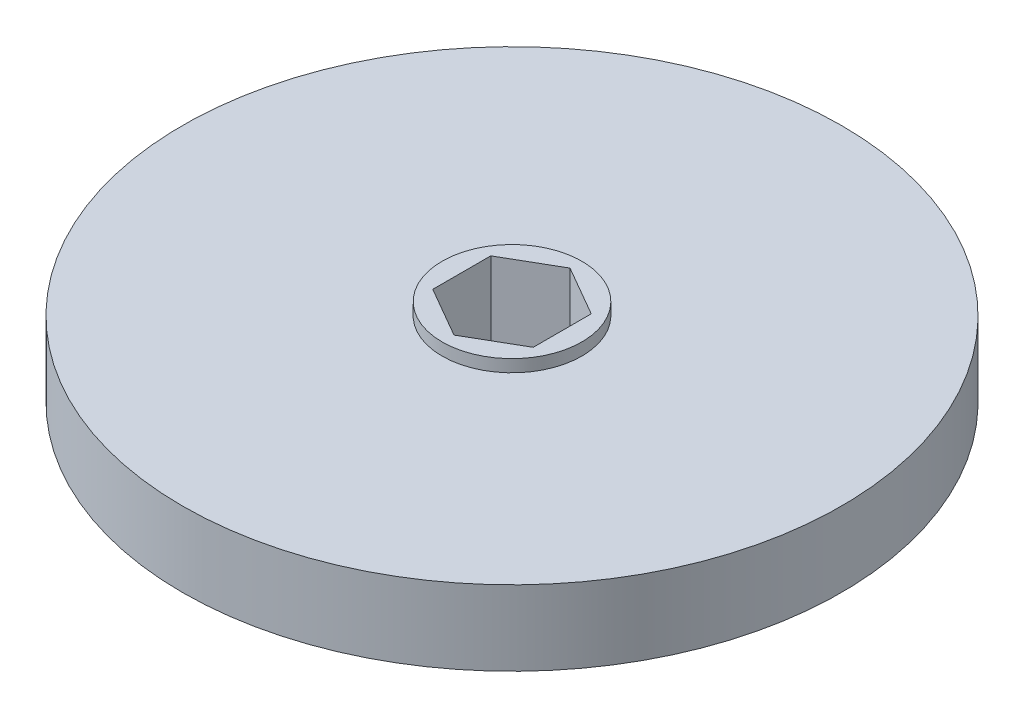
ISO-10303-21;
HEADER;
FILE_DESCRIPTION(('STEP AP214'),'2;1');
FILE_NAME('part.step','',(''),(''),'','','');
FILE_SCHEMA(('AUTOMOTIVE_DESIGN { 1 0 10303 214 1 1 1 1 }'));
ENDSEC;
DATA;
#1=APPLICATION_CONTEXT('core data for automotive mechanical design processes');
#2=APPLICATION_PROTOCOL_DEFINITION('international standard','automotive_design',2000,#1);
#3=PRODUCT_CONTEXT('',#1,'mechanical');
#4=PRODUCT('Part','Part','',(#3));
#5=PRODUCT_RELATED_PRODUCT_CATEGORY('part','',(#4));
#6=PRODUCT_DEFINITION_FORMATION('','',#4);
#7=PRODUCT_DEFINITION_CONTEXT('part definition',#1,'design');
#8=PRODUCT_DEFINITION('design','',#6,#7);
#9=PRODUCT_DEFINITION_SHAPE('','',#8);
#10=(LENGTH_UNIT() NAMED_UNIT(*) SI_UNIT(.MILLI.,.METRE.));
#11=(NAMED_UNIT(*) PLANE_ANGLE_UNIT() SI_UNIT($,.RADIAN.));
#12=(NAMED_UNIT(*) SI_UNIT($,.STERADIAN.) SOLID_ANGLE_UNIT());
#13=UNCERTAINTY_MEASURE_WITH_UNIT(LENGTH_MEASURE(1.E-05),#10,'distance_accuracy_value','');
#14=(GEOMETRIC_REPRESENTATION_CONTEXT(3) GLOBAL_UNCERTAINTY_ASSIGNED_CONTEXT((#13)) GLOBAL_UNIT_ASSIGNED_CONTEXT((#10,
#11,#12)) REPRESENTATION_CONTEXT('',''));
#15=CARTESIAN_POINT('',(0.,0.,0.));
#16=DIRECTION('',(0.,0.,1.));
#17=DIRECTION('',(1.,0.,0.));
#18=AXIS2_PLACEMENT_3D('',#15,#16,#17);
#19=CARTESIAN_POINT('',(0.,4.7625,0.));
#20=DIRECTION('',(0.,-1.,0.));
#21=DIRECTION('',(0.,0.,-1.));
#22=AXIS2_PLACEMENT_3D('',#19,#20,#21);
#23=CYLINDRICAL_SURFACE('',#22,41.91);
#24=CARTESIAN_POINT('',(0.,4.7625,0.));
#25=DIRECTION('',(0.,1.,0.));
#26=DIRECTION('',(0.,0.,1.));
#27=AXIS2_PLACEMENT_3D('',#24,#25,#26);
#28=CIRCLE('',#27,41.91);
#29=CARTESIAN_POINT('',(0.,4.7625,41.91));
#30=VERTEX_POINT('',#29);
#31=EDGE_CURVE('E40',#30,#30,#28,.T.);
#32=ORIENTED_EDGE('',*,*,#31,.F.);
#33=EDGE_LOOP('',(#32));
#34=FACE_BOUND('',#33,.T.);
#35=CARTESIAN_POINT('',(0.,-4.7625,0.));
#36=DIRECTION('',(0.,1.,0.));
#37=DIRECTION('',(0.,0.,1.));
#38=AXIS2_PLACEMENT_3D('',#35,#36,#37);
#39=CIRCLE('',#38,41.91);
#40=CARTESIAN_POINT('',(0.,-4.7625,41.91));
#41=VERTEX_POINT('',#40);
#42=EDGE_CURVE('E146',#41,#41,#39,.T.);
#43=ORIENTED_EDGE('',*,*,#42,.T.);
#44=EDGE_LOOP('',(#43));
#45=FACE_BOUND('',#44,.T.);
#46=ADVANCED_FACE('F33',(#34,#45),#23,.T.);
#47=CARTESIAN_POINT('',(0.,4.7625,0.));
#48=DIRECTION('',(0.,1.,0.));
#49=DIRECTION('',(0.,0.,1.));
#50=AXIS2_PLACEMENT_3D('',#47,#48,#49);
#51=PLANE('',#50);
#52=CARTESIAN_POINT('',(0.,4.7625,0.));
#53=DIRECTION('',(0.,1.,0.));
#54=DIRECTION('',(0.,0.,1.));
#55=AXIS2_PLACEMENT_3D('',#52,#53,#54);
#56=CIRCLE('',#55,8.89);
#57=CARTESIAN_POINT('',(0.,4.7625,8.89));
#58=VERTEX_POINT('',#57);
#59=EDGE_CURVE('E141',#58,#58,#56,.F.);
#60=ORIENTED_EDGE('',*,*,#59,.T.);
#61=EDGE_LOOP('',(#60));
#62=FACE_BOUND('',#61,.T.);
#63=ORIENTED_EDGE('',*,*,#31,.T.);
#64=EDGE_LOOP('',(#63));
#65=FACE_BOUND('',#64,.T.);
#66=ADVANCED_FACE('F154',(#62,#65),#51,.T.);
#67=CARTESIAN_POINT('',(0.,-4.7625,0.));
#68=DIRECTION('',(0.,1.,0.));
#69=DIRECTION('',(0.,0.,1.));
#70=AXIS2_PLACEMENT_3D('',#67,#68,#69);
#71=PLANE('',#70);
#72=CARTESIAN_POINT('',(0.,-4.7625,0.));
#73=DIRECTION('',(0.,1.,0.));
#74=DIRECTION('',(0.,0.,1.));
#75=AXIS2_PLACEMENT_3D('',#72,#73,#74);
#76=CIRCLE('',#75,8.89);
#77=CARTESIAN_POINT('',(0.,-4.7625,8.89));
#78=VERTEX_POINT('',#77);
#79=EDGE_CURVE('E11',#78,#78,#76,.F.);
#80=ORIENTED_EDGE('',*,*,#79,.F.);
#81=EDGE_LOOP('',(#80));
#82=FACE_BOUND('',#81,.T.);
#83=ORIENTED_EDGE('',*,*,#42,.F.);
#84=EDGE_LOOP('',(#83));
#85=FACE_BOUND('',#84,.T.);
#86=ADVANCED_FACE('F152',(#82,#85),#71,.F.);
#87=CARTESIAN_POINT('',(0.,-6.3246,0.));
#88=DIRECTION('',(0.,1.,0.));
#89=DIRECTION('',(0.,0.,1.));
#90=AXIS2_PLACEMENT_3D('',#87,#88,#89);
#91=PLANE('',#90);
#92=DIRECTION('',(0.,0.,-1.));
#93=VECTOR('',#92,1.);
#94=CARTESIAN_POINT('',(6.3881,-6.3246,3.68817125461025));
#95=LINE('',#94,#93);
#96=CARTESIAN_POINT('',(6.3881,-6.3246,3.68817125461025));
#97=VERTEX_POINT('',#96);
#98=CARTESIAN_POINT('',(6.3881,-6.3246,-3.68817125461025));
#99=VERTEX_POINT('',#98);
#100=EDGE_CURVE('E93',#97,#99,#95,.T.);
#101=ORIENTED_EDGE('',*,*,#100,.T.);
#102=DIRECTION('',(-0.866025403784439,0.,-0.5));
#103=VECTOR('',#102,1.);
#104=CARTESIAN_POINT('',(6.3881,-6.3246,-3.68817125461025));
#105=LINE('',#104,#103);
#106=CARTESIAN_POINT('',(0.,-6.3246,-7.3763425092205));
#107=VERTEX_POINT('',#106);
#108=EDGE_CURVE('E87',#99,#107,#105,.T.);
#109=ORIENTED_EDGE('',*,*,#108,.T.);
#110=DIRECTION('',(-0.866025403784439,0.,0.5));
#111=VECTOR('',#110,1.);
#112=CARTESIAN_POINT('',(0.,-6.3246,-7.3763425092205));
#113=LINE('',#112,#111);
#114=CARTESIAN_POINT('',(-6.3881,-6.3246,-3.68817125461025));
#115=VERTEX_POINT('',#114);
#116=EDGE_CURVE('E96',#107,#115,#113,.T.);
#117=ORIENTED_EDGE('',*,*,#116,.T.);
#118=DIRECTION('',(0.,0.,1.));
#119=VECTOR('',#118,1.);
#120=CARTESIAN_POINT('',(-6.3881,-6.3246,-3.68817125461025));
#121=LINE('',#120,#119);
#122=CARTESIAN_POINT('',(-6.3881,-6.3246,3.68817125461025));
#123=VERTEX_POINT('',#122);
#124=EDGE_CURVE('E47',#115,#123,#121,.T.);
#125=ORIENTED_EDGE('',*,*,#124,.T.);
#126=DIRECTION('',(0.866025403784439,0.,0.5));
#127=VECTOR('',#126,1.);
#128=CARTESIAN_POINT('',(-6.3881,-6.3246,3.68817125461025));
#129=LINE('',#128,#127);
#130=CARTESIAN_POINT('',(0.,-6.3246,7.3763425092205));
#131=VERTEX_POINT('',#130);
#132=EDGE_CURVE('E111',#123,#131,#129,.T.);
#133=ORIENTED_EDGE('',*,*,#132,.T.);
#134=DIRECTION('',(0.866025403784438,0.,-0.5));
#135=VECTOR('',#134,1.);
#136=CARTESIAN_POINT('',(0.,-6.3246,7.3763425092205));
#137=LINE('',#136,#135);
#138=EDGE_CURVE('E114',#131,#97,#137,.T.);
#139=ORIENTED_EDGE('',*,*,#138,.T.);
#140=EDGE_LOOP('',(#101,#109,#117,#125,#133,#139));
#141=FACE_BOUND('',#140,.T.);
#142=CARTESIAN_POINT('',(0.,-6.3246,0.));
#143=DIRECTION('',(0.,1.,0.));
#144=DIRECTION('',(0.,0.,1.));
#145=AXIS2_PLACEMENT_3D('',#142,#143,#144);
#146=CIRCLE('',#145,8.89);
#147=CARTESIAN_POINT('',(0.,-6.3246,8.89));
#148=VERTEX_POINT('',#147);
#149=EDGE_CURVE('E130',#148,#148,#146,.T.);
#150=ORIENTED_EDGE('',*,*,#149,.F.);
#151=EDGE_LOOP('',(#150));
#152=FACE_BOUND('',#151,.T.);
#153=ADVANCED_FACE('F100',(#141,#152),#91,.F.);
#154=CARTESIAN_POINT('',(0.,6.3246,0.));
#155=DIRECTION('',(0.,-1.,0.));
#156=DIRECTION('',(0.,0.,-1.));
#157=AXIS2_PLACEMENT_3D('',#154,#155,#156);
#158=CYLINDRICAL_SURFACE('',#157,8.89);
#159=ORIENTED_EDGE('',*,*,#149,.T.);
#160=EDGE_LOOP('',(#159));
#161=FACE_BOUND('',#160,.T.);
#162=ORIENTED_EDGE('',*,*,#79,.T.);
#163=EDGE_LOOP('',(#162));
#164=FACE_BOUND('',#163,.T.);
#165=ADVANCED_FACE('F160',(#161,#164),#158,.T.);
#166=ORIENTED_EDGE('',*,*,#59,.F.);
#167=EDGE_LOOP('',(#166));
#168=FACE_BOUND('',#167,.T.);
#169=CARTESIAN_POINT('',(0.,6.3246,0.));
#170=DIRECTION('',(0.,1.,0.));
#171=DIRECTION('',(0.,0.,1.));
#172=AXIS2_PLACEMENT_3D('',#169,#170,#171);
#173=CIRCLE('',#172,8.89);
#174=CARTESIAN_POINT('',(0.,6.3246,8.89));
#175=VERTEX_POINT('',#174);
#176=EDGE_CURVE('E138',#175,#175,#173,.T.);
#177=ORIENTED_EDGE('',*,*,#176,.F.);
#178=EDGE_LOOP('',(#177));
#179=FACE_BOUND('',#178,.T.);
#180=ADVANCED_FACE('F189',(#168,#179),#158,.T.);
#181=CARTESIAN_POINT('',(0.,6.3246,0.));
#182=DIRECTION('',(0.,1.,0.));
#183=DIRECTION('',(0.,0.,1.));
#184=AXIS2_PLACEMENT_3D('',#181,#182,#183);
#185=PLANE('',#184);
#186=DIRECTION('',(-0.866025403784439,0.,-0.5));
#187=VECTOR('',#186,1.);
#188=CARTESIAN_POINT('',(6.3881,6.3246,-3.68817125461025));
#189=LINE('',#188,#187);
#190=CARTESIAN_POINT('',(6.3881,6.3246,-3.68817125461025));
#191=VERTEX_POINT('',#190);
#192=CARTESIAN_POINT('',(0.,6.3246,-7.3763425092205));
#193=VERTEX_POINT('',#192);
#194=EDGE_CURVE('E55',#191,#193,#189,.T.);
#195=ORIENTED_EDGE('',*,*,#194,.F.);
#196=DIRECTION('',(0.,0.,-1.));
#197=VECTOR('',#196,1.);
#198=CARTESIAN_POINT('',(6.3881,6.3246,3.68817125461025));
#199=LINE('',#198,#197);
#200=CARTESIAN_POINT('',(6.3881,6.3246,3.68817125461025));
#201=VERTEX_POINT('',#200);
#202=EDGE_CURVE('E104',#201,#191,#199,.T.);
#203=ORIENTED_EDGE('',*,*,#202,.F.);
#204=DIRECTION('',(0.866025403784438,0.,-0.5));
#205=VECTOR('',#204,1.);
#206=CARTESIAN_POINT('',(0.,6.3246,7.3763425092205));
#207=LINE('',#206,#205);
#208=CARTESIAN_POINT('',(0.,6.3246,7.3763425092205));
#209=VERTEX_POINT('',#208);
#210=EDGE_CURVE('E107',#209,#201,#207,.T.);
#211=ORIENTED_EDGE('',*,*,#210,.F.);
#212=DIRECTION('',(0.866025403784439,0.,0.5));
#213=VECTOR('',#212,1.);
#214=CARTESIAN_POINT('',(-6.3881,6.3246,3.68817125461025));
#215=LINE('',#214,#213);
#216=CARTESIAN_POINT('',(-6.3881,6.3246,3.68817125461025));
#217=VERTEX_POINT('',#216);
#218=EDGE_CURVE('E123',#217,#209,#215,.T.);
#219=ORIENTED_EDGE('',*,*,#218,.F.);
#220=DIRECTION('',(0.,0.,1.));
#221=VECTOR('',#220,1.);
#222=CARTESIAN_POINT('',(-6.3881,6.3246,-3.68817125461025));
#223=LINE('',#222,#221);
#224=CARTESIAN_POINT('',(-6.3881,6.3246,-3.68817125461025));
#225=VERTEX_POINT('',#224);
#226=EDGE_CURVE('E120',#225,#217,#223,.T.);
#227=ORIENTED_EDGE('',*,*,#226,.F.);
#228=DIRECTION('',(-0.866025403784439,0.,0.5));
#229=VECTOR('',#228,1.);
#230=CARTESIAN_POINT('',(0.,6.3246,-7.3763425092205));
#231=LINE('',#230,#229);
#232=EDGE_CURVE('E118',#193,#225,#231,.T.);
#233=ORIENTED_EDGE('',*,*,#232,.F.);
#234=EDGE_LOOP('',(#195,#203,#211,#219,#227,#233));
#235=FACE_BOUND('',#234,.T.);
#236=ORIENTED_EDGE('',*,*,#176,.T.);
#237=EDGE_LOOP('',(#236));
#238=FACE_BOUND('',#237,.T.);
#239=ADVANCED_FACE('F199',(#235,#238),#185,.T.);
#240=CARTESIAN_POINT('',(6.3881,-6.3246,-3.68817125461025));
#241=DIRECTION('',(0.5,0.,-0.866025403784439));
#242=DIRECTION('',(-0.866025403784439,0.,-0.5));
#243=AXIS2_PLACEMENT_3D('',#240,#241,#242);
#244=PLANE('',#243);
#245=ORIENTED_EDGE('',*,*,#194,.T.);
#246=DIRECTION('',(0.,1.,0.));
#247=VECTOR('',#246,1.);
#248=CARTESIAN_POINT('',(0.,-6.3246,-7.3763425092205));
#249=LINE('',#248,#247);
#250=EDGE_CURVE('E83',#107,#193,#249,.T.);
#251=ORIENTED_EDGE('',*,*,#250,.F.);
#252=ORIENTED_EDGE('',*,*,#108,.F.);
#253=DIRECTION('',(0.,1.,0.));
#254=VECTOR('',#253,1.);
#255=CARTESIAN_POINT('',(6.3881,-6.3246,-3.68817125461025));
#256=LINE('',#255,#254);
#257=EDGE_CURVE('E128',#99,#191,#256,.T.);
#258=ORIENTED_EDGE('',*,*,#257,.T.);
#259=EDGE_LOOP('',(#245,#251,#252,#258));
#260=FACE_BOUND('',#259,.T.);
#261=ADVANCED_FACE('F85',(#260),#244,.F.);
#262=CARTESIAN_POINT('',(6.3881,-6.3246,3.68817125461025));
#263=DIRECTION('',(1.,0.,0.));
#264=DIRECTION('',(0.,0.,-1.));
#265=AXIS2_PLACEMENT_3D('',#262,#263,#264);
#266=PLANE('',#265);
#267=ORIENTED_EDGE('',*,*,#202,.T.);
#268=ORIENTED_EDGE('',*,*,#257,.F.);
#269=ORIENTED_EDGE('',*,*,#100,.F.);
#270=DIRECTION('',(0.,1.,0.));
#271=VECTOR('',#270,1.);
#272=CARTESIAN_POINT('',(6.3881,-6.3246,3.68817125461025));
#273=LINE('',#272,#271);
#274=EDGE_CURVE('E131',#97,#201,#273,.T.);
#275=ORIENTED_EDGE('',*,*,#274,.T.);
#276=EDGE_LOOP('',(#267,#268,#269,#275));
#277=FACE_BOUND('',#276,.T.);
#278=ADVANCED_FACE('F222',(#277),#266,.F.);
#279=CARTESIAN_POINT('',(0.,-6.3246,7.3763425092205));
#280=DIRECTION('',(0.5,0.,0.866025403784439));
#281=DIRECTION('',(0.866025403784439,0.,-0.5));
#282=AXIS2_PLACEMENT_3D('',#279,#280,#281);
#283=PLANE('',#282);
#284=ORIENTED_EDGE('',*,*,#210,.T.);
#285=ORIENTED_EDGE('',*,*,#274,.F.);
#286=ORIENTED_EDGE('',*,*,#138,.F.);
#287=DIRECTION('',(0.,1.,0.));
#288=VECTOR('',#287,1.);
#289=CARTESIAN_POINT('',(0.,-6.3246,7.3763425092205));
#290=LINE('',#289,#288);
#291=EDGE_CURVE('E133',#131,#209,#290,.T.);
#292=ORIENTED_EDGE('',*,*,#291,.T.);
#293=EDGE_LOOP('',(#284,#285,#286,#292));
#294=FACE_BOUND('',#293,.T.);
#295=ADVANCED_FACE('F231',(#294),#283,.F.);
#296=CARTESIAN_POINT('',(-6.3881,-6.3246,3.68817125461025));
#297=DIRECTION('',(-0.5,0.,0.866025403784439));
#298=DIRECTION('',(0.866025403784439,0.,0.5));
#299=AXIS2_PLACEMENT_3D('',#296,#297,#298);
#300=PLANE('',#299);
#301=ORIENTED_EDGE('',*,*,#218,.T.);
#302=ORIENTED_EDGE('',*,*,#291,.F.);
#303=ORIENTED_EDGE('',*,*,#132,.F.);
#304=DIRECTION('',(0.,1.,0.));
#305=VECTOR('',#304,1.);
#306=CARTESIAN_POINT('',(-6.3881,-6.3246,3.68817125461025));
#307=LINE('',#306,#305);
#308=EDGE_CURVE('E135',#123,#217,#307,.T.);
#309=ORIENTED_EDGE('',*,*,#308,.T.);
#310=EDGE_LOOP('',(#301,#302,#303,#309));
#311=FACE_BOUND('',#310,.T.);
#312=ADVANCED_FACE('F241',(#311),#300,.F.);
#313=CARTESIAN_POINT('',(-6.3881,-6.3246,-3.68817125461025));
#314=DIRECTION('',(-1.,0.,0.));
#315=DIRECTION('',(0.,0.,1.));
#316=AXIS2_PLACEMENT_3D('',#313,#314,#315);
#317=PLANE('',#316);
#318=ORIENTED_EDGE('',*,*,#226,.T.);
#319=ORIENTED_EDGE('',*,*,#308,.F.);
#320=ORIENTED_EDGE('',*,*,#124,.F.);
#321=DIRECTION('',(0.,1.,0.));
#322=VECTOR('',#321,1.);
#323=CARTESIAN_POINT('',(-6.3881,-6.3246,-3.68817125461025));
#324=LINE('',#323,#322);
#325=EDGE_CURVE('E92',#115,#225,#324,.T.);
#326=ORIENTED_EDGE('',*,*,#325,.T.);
#327=EDGE_LOOP('',(#318,#319,#320,#326));
#328=FACE_BOUND('',#327,.T.);
#329=ADVANCED_FACE('F251',(#328),#317,.F.);
#330=CARTESIAN_POINT('',(0.,-6.3246,-7.3763425092205));
#331=DIRECTION('',(-0.5,0.,-0.866025403784439));
#332=DIRECTION('',(-0.866025403784439,0.,0.5));
#333=AXIS2_PLACEMENT_3D('',#330,#331,#332);
#334=PLANE('',#333);
#335=ORIENTED_EDGE('',*,*,#232,.T.);
#336=ORIENTED_EDGE('',*,*,#325,.F.);
#337=ORIENTED_EDGE('',*,*,#116,.F.);
#338=ORIENTED_EDGE('',*,*,#250,.T.);
#339=EDGE_LOOP('',(#335,#336,#337,#338));
#340=FACE_BOUND('',#339,.T.);
#341=ADVANCED_FACE('F97',(#340),#334,.F.);
#342=CLOSED_SHELL('',(#46,#66,#86,#153,#165,#180,#239,#261,#278,#295,#312,#329,#341));
#343=MANIFOLD_SOLID_BREP('B2',#342);
#344=ADVANCED_BREP_SHAPE_REPRESENTATION('',(#18,#343),#14);
#345=SHAPE_DEFINITION_REPRESENTATION(#9,#344);
ENDSEC;
END-ISO-10303-21;
